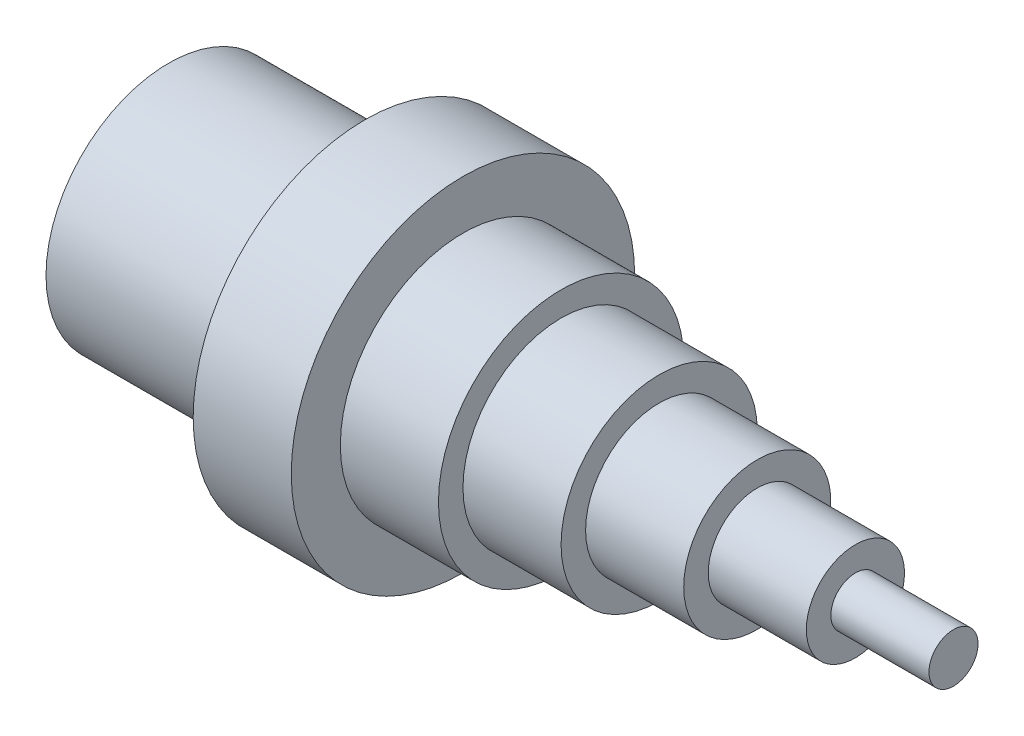
ISO-10303-21;
HEADER;
FILE_DESCRIPTION(('STEP AP214'),'2;1');
FILE_NAME('part.step','',(''),(''),'','','');
FILE_SCHEMA(('AUTOMOTIVE_DESIGN { 1 0 10303 214 1 1 1 1 }'));
ENDSEC;
DATA;
#1=APPLICATION_CONTEXT('core data for automotive mechanical design processes');
#2=APPLICATION_PROTOCOL_DEFINITION('international standard','automotive_design',2000,#1);
#3=PRODUCT_CONTEXT('',#1,'mechanical');
#4=PRODUCT('Part','Part','',(#3));
#5=PRODUCT_RELATED_PRODUCT_CATEGORY('part','',(#4));
#6=PRODUCT_DEFINITION_FORMATION('','',#4);
#7=PRODUCT_DEFINITION_CONTEXT('part definition',#1,'design');
#8=PRODUCT_DEFINITION('design','',#6,#7);
#9=PRODUCT_DEFINITION_SHAPE('','',#8);
#10=(LENGTH_UNIT() NAMED_UNIT(*) SI_UNIT(.MILLI.,.METRE.));
#11=(NAMED_UNIT(*) PLANE_ANGLE_UNIT() SI_UNIT($,.RADIAN.));
#12=(NAMED_UNIT(*) SI_UNIT($,.STERADIAN.) SOLID_ANGLE_UNIT());
#13=UNCERTAINTY_MEASURE_WITH_UNIT(LENGTH_MEASURE(1.E-05),#10,'distance_accuracy_value','');
#14=(GEOMETRIC_REPRESENTATION_CONTEXT(3) GLOBAL_UNCERTAINTY_ASSIGNED_CONTEXT((#13)) GLOBAL_UNIT_ASSIGNED_CONTEXT((#10,
#11,#12)) REPRESENTATION_CONTEXT('',''));
#15=CARTESIAN_POINT('',(0.,0.,0.));
#16=DIRECTION('',(0.,0.,1.));
#17=DIRECTION('',(1.,0.,0.));
#18=AXIS2_PLACEMENT_3D('',#15,#16,#17);
#19=CARTESIAN_POINT('',(0.,0.,0.));
#20=DIRECTION('',(1.,0.,0.));
#21=DIRECTION('',(0.,0.,-1.));
#22=AXIS2_PLACEMENT_3D('',#19,#20,#21);
#23=PLANE('',#22);
#24=CARTESIAN_POINT('',(0.,0.,0.));
#25=DIRECTION('',(-1.,0.,0.));
#26=DIRECTION('',(0.,0.,1.));
#27=AXIS2_PLACEMENT_3D('',#24,#25,#26);
#28=CIRCLE('',#27,20.);
#29=CARTESIAN_POINT('',(0.,0.,20.));
#30=VERTEX_POINT('',#29);
#31=EDGE_CURVE('E81',#30,#30,#28,.T.);
#32=ORIENTED_EDGE('',*,*,#31,.F.);
#33=EDGE_LOOP('',(#32));
#34=FACE_BOUND('',#33,.T.);
#35=CARTESIAN_POINT('',(0.,0.,0.));
#36=DIRECTION('',(-1.,0.,0.));
#37=DIRECTION('',(0.,0.,1.));
#38=AXIS2_PLACEMENT_3D('',#35,#36,#37);
#39=CIRCLE('',#38,25.);
#40=CARTESIAN_POINT('',(0.,0.,25.));
#41=VERTEX_POINT('',#40);
#42=EDGE_CURVE('E10',#41,#41,#39,.T.);
#43=ORIENTED_EDGE('',*,*,#42,.T.);
#44=EDGE_LOOP('',(#43));
#45=FACE_BOUND('',#44,.T.);
#46=ADVANCED_FACE('F31',(#34,#45),#23,.F.);
#47=CARTESIAN_POINT('',(0.,0.,0.));
#48=DIRECTION('',(-1.,0.,0.));
#49=DIRECTION('',(0.,0.,1.));
#50=AXIS2_PLACEMENT_3D('',#47,#48,#49);
#51=CYLINDRICAL_SURFACE('',#50,25.);
#52=ORIENTED_EDGE('',*,*,#42,.F.);
#53=EDGE_LOOP('',(#52));
#54=FACE_BOUND('',#53,.T.);
#55=CARTESIAN_POINT('',(40.,0.,0.));
#56=DIRECTION('',(-1.,0.,0.));
#57=DIRECTION('',(0.,0.,1.));
#58=AXIS2_PLACEMENT_3D('',#55,#56,#57);
#59=CIRCLE('',#58,25.);
#60=CARTESIAN_POINT('',(40.,0.,25.));
#61=VERTEX_POINT('',#60);
#62=EDGE_CURVE('E37',#61,#61,#59,.T.);
#63=ORIENTED_EDGE('',*,*,#62,.T.);
#64=EDGE_LOOP('',(#63));
#65=FACE_BOUND('',#64,.T.);
#66=ADVANCED_FACE('F97',(#54,#65),#51,.T.);
#67=CARTESIAN_POINT('',(40.,25.,0.));
#68=DIRECTION('',(1.,0.,0.));
#69=DIRECTION('',(0.,0.,-1.));
#70=AXIS2_PLACEMENT_3D('',#67,#68,#69);
#71=PLANE('',#70);
#72=ORIENTED_EDGE('',*,*,#62,.F.);
#73=EDGE_LOOP('',(#72));
#74=FACE_BOUND('',#73,.T.);
#75=CARTESIAN_POINT('',(40.,0.,0.));
#76=DIRECTION('',(-1.,0.,0.));
#77=DIRECTION('',(0.,0.,1.));
#78=AXIS2_PLACEMENT_3D('',#75,#76,#77);
#79=CIRCLE('',#78,35.);
#80=CARTESIAN_POINT('',(40.,0.,35.));
#81=VERTEX_POINT('',#80);
#82=EDGE_CURVE('E41',#81,#81,#79,.T.);
#83=ORIENTED_EDGE('',*,*,#82,.T.);
#84=EDGE_LOOP('',(#83));
#85=FACE_BOUND('',#84,.T.);
#86=ADVANCED_FACE('F101',(#74,#85),#71,.F.);
#87=CARTESIAN_POINT('',(0.,0.,0.));
#88=DIRECTION('',(-1.,0.,0.));
#89=DIRECTION('',(0.,0.,1.));
#90=AXIS2_PLACEMENT_3D('',#87,#88,#89);
#91=CYLINDRICAL_SURFACE('',#90,35.);
#92=ORIENTED_EDGE('',*,*,#82,.F.);
#93=EDGE_LOOP('',(#92));
#94=FACE_BOUND('',#93,.T.);
#95=CARTESIAN_POINT('',(60.,0.,0.));
#96=DIRECTION('',(-1.,0.,0.));
#97=DIRECTION('',(0.,0.,1.));
#98=AXIS2_PLACEMENT_3D('',#95,#96,#97);
#99=CIRCLE('',#98,35.);
#100=CARTESIAN_POINT('',(60.,0.,35.));
#101=VERTEX_POINT('',#100);
#102=EDGE_CURVE('E45',#101,#101,#99,.T.);
#103=ORIENTED_EDGE('',*,*,#102,.T.);
#104=EDGE_LOOP('',(#103));
#105=FACE_BOUND('',#104,.T.);
#106=ADVANCED_FACE('F106',(#94,#105),#91,.T.);
#107=CARTESIAN_POINT('',(60.,35.,0.));
#108=DIRECTION('',(-1.,0.,0.));
#109=DIRECTION('',(0.,0.,1.));
#110=AXIS2_PLACEMENT_3D('',#107,#108,#109);
#111=PLANE('',#110);
#112=ORIENTED_EDGE('',*,*,#102,.F.);
#113=EDGE_LOOP('',(#112));
#114=FACE_BOUND('',#113,.T.);
#115=CARTESIAN_POINT('',(60.,0.,0.));
#116=DIRECTION('',(-1.,0.,0.));
#117=DIRECTION('',(0.,0.,1.));
#118=AXIS2_PLACEMENT_3D('',#115,#116,#117);
#119=CIRCLE('',#118,25.);
#120=CARTESIAN_POINT('',(60.,0.,25.));
#121=VERTEX_POINT('',#120);
#122=EDGE_CURVE('E50',#121,#121,#119,.T.);
#123=ORIENTED_EDGE('',*,*,#122,.T.);
#124=EDGE_LOOP('',(#123));
#125=FACE_BOUND('',#124,.T.);
#126=ADVANCED_FACE('F112',(#114,#125),#111,.F.);
#127=CARTESIAN_POINT('',(0.,0.,0.));
#128=DIRECTION('',(-1.,0.,0.));
#129=DIRECTION('',(0.,0.,1.));
#130=AXIS2_PLACEMENT_3D('',#127,#128,#129);
#131=CYLINDRICAL_SURFACE('',#130,25.);
#132=ORIENTED_EDGE('',*,*,#122,.F.);
#133=EDGE_LOOP('',(#132));
#134=FACE_BOUND('',#133,.T.);
#135=CARTESIAN_POINT('',(80.,0.,0.));
#136=DIRECTION('',(-1.,0.,0.));
#137=DIRECTION('',(0.,0.,1.));
#138=AXIS2_PLACEMENT_3D('',#135,#136,#137);
#139=CIRCLE('',#138,25.);
#140=CARTESIAN_POINT('',(80.,0.,25.));
#141=VERTEX_POINT('',#140);
#142=EDGE_CURVE('E53',#141,#141,#139,.T.);
#143=ORIENTED_EDGE('',*,*,#142,.T.);
#144=EDGE_LOOP('',(#143));
#145=FACE_BOUND('',#144,.T.);
#146=ADVANCED_FACE('F116',(#134,#145),#131,.T.);
#147=CARTESIAN_POINT('',(80.,25.,0.));
#148=DIRECTION('',(-1.,0.,0.));
#149=DIRECTION('',(0.,0.,1.));
#150=AXIS2_PLACEMENT_3D('',#147,#148,#149);
#151=PLANE('',#150);
#152=ORIENTED_EDGE('',*,*,#142,.F.);
#153=EDGE_LOOP('',(#152));
#154=FACE_BOUND('',#153,.T.);
#155=CARTESIAN_POINT('',(80.,0.,0.));
#156=DIRECTION('',(-1.,0.,0.));
#157=DIRECTION('',(0.,0.,1.));
#158=AXIS2_PLACEMENT_3D('',#155,#156,#157);
#159=CIRCLE('',#158,20.);
#160=CARTESIAN_POINT('',(80.,0.,20.));
#161=VERTEX_POINT('',#160);
#162=EDGE_CURVE('E56',#161,#161,#159,.T.);
#163=ORIENTED_EDGE('',*,*,#162,.T.);
#164=EDGE_LOOP('',(#163));
#165=FACE_BOUND('',#164,.T.);
#166=ADVANCED_FACE('F120',(#154,#165),#151,.F.);
#167=CARTESIAN_POINT('',(0.,0.,0.));
#168=DIRECTION('',(-1.,0.,0.));
#169=DIRECTION('',(0.,0.,1.));
#170=AXIS2_PLACEMENT_3D('',#167,#168,#169);
#171=CYLINDRICAL_SURFACE('',#170,20.);
#172=ORIENTED_EDGE('',*,*,#162,.F.);
#173=EDGE_LOOP('',(#172));
#174=FACE_BOUND('',#173,.T.);
#175=CARTESIAN_POINT('',(100.,0.,0.));
#176=DIRECTION('',(-1.,0.,0.));
#177=DIRECTION('',(0.,0.,1.));
#178=AXIS2_PLACEMENT_3D('',#175,#176,#177);
#179=CIRCLE('',#178,20.);
#180=CARTESIAN_POINT('',(100.,0.,20.));
#181=VERTEX_POINT('',#180);
#182=EDGE_CURVE('E59',#181,#181,#179,.T.);
#183=ORIENTED_EDGE('',*,*,#182,.T.);
#184=EDGE_LOOP('',(#183));
#185=FACE_BOUND('',#184,.T.);
#186=ADVANCED_FACE('F124',(#174,#185),#171,.T.);
#187=CARTESIAN_POINT('',(100.,20.,0.));
#188=DIRECTION('',(-1.,0.,0.));
#189=DIRECTION('',(0.,0.,1.));
#190=AXIS2_PLACEMENT_3D('',#187,#188,#189);
#191=PLANE('',#190);
#192=ORIENTED_EDGE('',*,*,#182,.F.);
#193=EDGE_LOOP('',(#192));
#194=FACE_BOUND('',#193,.T.);
#195=CARTESIAN_POINT('',(100.,0.,0.));
#196=DIRECTION('',(-1.,0.,0.));
#197=DIRECTION('',(0.,0.,1.));
#198=AXIS2_PLACEMENT_3D('',#195,#196,#197);
#199=CIRCLE('',#198,15.);
#200=CARTESIAN_POINT('',(100.,0.,15.));
#201=VERTEX_POINT('',#200);
#202=EDGE_CURVE('E62',#201,#201,#199,.T.);
#203=ORIENTED_EDGE('',*,*,#202,.T.);
#204=EDGE_LOOP('',(#203));
#205=FACE_BOUND('',#204,.T.);
#206=ADVANCED_FACE('F128',(#194,#205),#191,.F.);
#207=CARTESIAN_POINT('',(0.,0.,0.));
#208=DIRECTION('',(-1.,0.,0.));
#209=DIRECTION('',(0.,0.,1.));
#210=AXIS2_PLACEMENT_3D('',#207,#208,#209);
#211=CYLINDRICAL_SURFACE('',#210,15.);
#212=ORIENTED_EDGE('',*,*,#202,.F.);
#213=EDGE_LOOP('',(#212));
#214=FACE_BOUND('',#213,.T.);
#215=CARTESIAN_POINT('',(120.,0.,0.));
#216=DIRECTION('',(-1.,0.,0.));
#217=DIRECTION('',(0.,0.,1.));
#218=AXIS2_PLACEMENT_3D('',#215,#216,#217);
#219=CIRCLE('',#218,15.);
#220=CARTESIAN_POINT('',(120.,0.,15.));
#221=VERTEX_POINT('',#220);
#222=EDGE_CURVE('E65',#221,#221,#219,.T.);
#223=ORIENTED_EDGE('',*,*,#222,.T.);
#224=EDGE_LOOP('',(#223));
#225=FACE_BOUND('',#224,.T.);
#226=ADVANCED_FACE('F132',(#214,#225),#211,.T.);
#227=CARTESIAN_POINT('',(120.,15.,0.));
#228=DIRECTION('',(-1.,0.,0.));
#229=DIRECTION('',(0.,0.,1.));
#230=AXIS2_PLACEMENT_3D('',#227,#228,#229);
#231=PLANE('',#230);
#232=ORIENTED_EDGE('',*,*,#222,.F.);
#233=EDGE_LOOP('',(#232));
#234=FACE_BOUND('',#233,.T.);
#235=CARTESIAN_POINT('',(120.,0.,0.));
#236=DIRECTION('',(-1.,0.,0.));
#237=DIRECTION('',(0.,0.,1.));
#238=AXIS2_PLACEMENT_3D('',#235,#236,#237);
#239=CIRCLE('',#238,10.);
#240=CARTESIAN_POINT('',(120.,0.,10.));
#241=VERTEX_POINT('',#240);
#242=EDGE_CURVE('E68',#241,#241,#239,.T.);
#243=ORIENTED_EDGE('',*,*,#242,.T.);
#244=EDGE_LOOP('',(#243));
#245=FACE_BOUND('',#244,.T.);
#246=ADVANCED_FACE('F136',(#234,#245),#231,.F.);
#247=CARTESIAN_POINT('',(0.,0.,0.));
#248=DIRECTION('',(-1.,0.,0.));
#249=DIRECTION('',(0.,0.,1.));
#250=AXIS2_PLACEMENT_3D('',#247,#248,#249);
#251=CYLINDRICAL_SURFACE('',#250,10.);
#252=ORIENTED_EDGE('',*,*,#242,.F.);
#253=EDGE_LOOP('',(#252));
#254=FACE_BOUND('',#253,.T.);
#255=CARTESIAN_POINT('',(140.,0.,0.));
#256=DIRECTION('',(-1.,0.,0.));
#257=DIRECTION('',(0.,0.,1.));
#258=AXIS2_PLACEMENT_3D('',#255,#256,#257);
#259=CIRCLE('',#258,10.);
#260=CARTESIAN_POINT('',(140.,0.,10.));
#261=VERTEX_POINT('',#260);
#262=EDGE_CURVE('E71',#261,#261,#259,.T.);
#263=ORIENTED_EDGE('',*,*,#262,.T.);
#264=EDGE_LOOP('',(#263));
#265=FACE_BOUND('',#264,.T.);
#266=ADVANCED_FACE('F140',(#254,#265),#251,.T.);
#267=CARTESIAN_POINT('',(140.,10.,0.));
#268=DIRECTION('',(-1.,0.,0.));
#269=DIRECTION('',(0.,0.,1.));
#270=AXIS2_PLACEMENT_3D('',#267,#268,#269);
#271=PLANE('',#270);
#272=ORIENTED_EDGE('',*,*,#262,.F.);
#273=EDGE_LOOP('',(#272));
#274=FACE_BOUND('',#273,.T.);
#275=CARTESIAN_POINT('',(140.,0.,0.));
#276=DIRECTION('',(-1.,0.,0.));
#277=DIRECTION('',(0.,0.,1.));
#278=AXIS2_PLACEMENT_3D('',#275,#276,#277);
#279=CIRCLE('',#278,5.);
#280=CARTESIAN_POINT('',(140.,0.,5.));
#281=VERTEX_POINT('',#280);
#282=EDGE_CURVE('E74',#281,#281,#279,.T.);
#283=ORIENTED_EDGE('',*,*,#282,.T.);
#284=EDGE_LOOP('',(#283));
#285=FACE_BOUND('',#284,.T.);
#286=ADVANCED_FACE('F144',(#274,#285),#271,.F.);
#287=CARTESIAN_POINT('',(0.,0.,0.));
#288=DIRECTION('',(-1.,0.,0.));
#289=DIRECTION('',(0.,0.,1.));
#290=AXIS2_PLACEMENT_3D('',#287,#288,#289);
#291=CYLINDRICAL_SURFACE('',#290,5.);
#292=ORIENTED_EDGE('',*,*,#282,.F.);
#293=EDGE_LOOP('',(#292));
#294=FACE_BOUND('',#293,.T.);
#295=CARTESIAN_POINT('',(160.,0.,0.));
#296=DIRECTION('',(-1.,0.,0.));
#297=DIRECTION('',(0.,0.,1.));
#298=AXIS2_PLACEMENT_3D('',#295,#296,#297);
#299=CIRCLE('',#298,5.);
#300=CARTESIAN_POINT('',(160.,0.,5.));
#301=VERTEX_POINT('',#300);
#302=EDGE_CURVE('E77',#301,#301,#299,.T.);
#303=ORIENTED_EDGE('',*,*,#302,.T.);
#304=EDGE_LOOP('',(#303));
#305=FACE_BOUND('',#304,.T.);
#306=ADVANCED_FACE('F148',(#294,#305),#291,.T.);
#307=CARTESIAN_POINT('',(160.,5.,0.));
#308=DIRECTION('',(-1.,0.,0.));
#309=DIRECTION('',(0.,0.,1.));
#310=AXIS2_PLACEMENT_3D('',#307,#308,#309);
#311=PLANE('',#310);
#312=ORIENTED_EDGE('',*,*,#302,.F.);
#313=EDGE_LOOP('',(#312));
#314=FACE_BOUND('',#313,.T.);
#315=ADVANCED_FACE('F92',(#314),#311,.F.);
#316=CARTESIAN_POINT('',(40.,0.,0.));
#317=DIRECTION('',(-1.,0.,0.));
#318=DIRECTION('',(0.,0.,1.));
#319=AXIS2_PLACEMENT_3D('',#316,#317,#318);
#320=CYLINDRICAL_SURFACE('',#319,20.);
#321=CARTESIAN_POINT('',(40.,0.,0.));
#322=DIRECTION('',(-1.,0.,0.));
#323=DIRECTION('',(0.,0.,1.));
#324=AXIS2_PLACEMENT_3D('',#321,#322,#323);
#325=CIRCLE('',#324,20.);
#326=CARTESIAN_POINT('',(40.,0.,20.));
#327=VERTEX_POINT('',#326);
#328=EDGE_CURVE('E80',#327,#327,#325,.T.);
#329=ORIENTED_EDGE('',*,*,#328,.F.);
#330=EDGE_LOOP('',(#329));
#331=FACE_BOUND('',#330,.T.);
#332=ORIENTED_EDGE('',*,*,#31,.T.);
#333=EDGE_LOOP('',(#332));
#334=FACE_BOUND('',#333,.T.);
#335=ADVANCED_FACE('F89',(#331,#334),#320,.F.);
#336=CARTESIAN_POINT('',(40.,0.,0.));
#337=DIRECTION('',(-1.,0.,0.));
#338=DIRECTION('',(0.,0.,1.));
#339=AXIS2_PLACEMENT_3D('',#336,#337,#338);
#340=PLANE('',#339);
#341=ORIENTED_EDGE('',*,*,#328,.T.);
#342=EDGE_LOOP('',(#341));
#343=FACE_BOUND('',#342,.T.);
#344=ADVANCED_FACE('F87',(#343),#340,.T.);
#345=CLOSED_SHELL('',(#46,#66,#86,#106,#126,#146,#166,#186,#206,#226,#246,#266,#286,#306,#315,
#335,#344));
#346=MANIFOLD_SOLID_BREP('B2',#345);
#347=ADVANCED_BREP_SHAPE_REPRESENTATION('',(#18,#346),#14);
#348=SHAPE_DEFINITION_REPRESENTATION(#9,#347);
ENDSEC;
END-ISO-10303-21;
